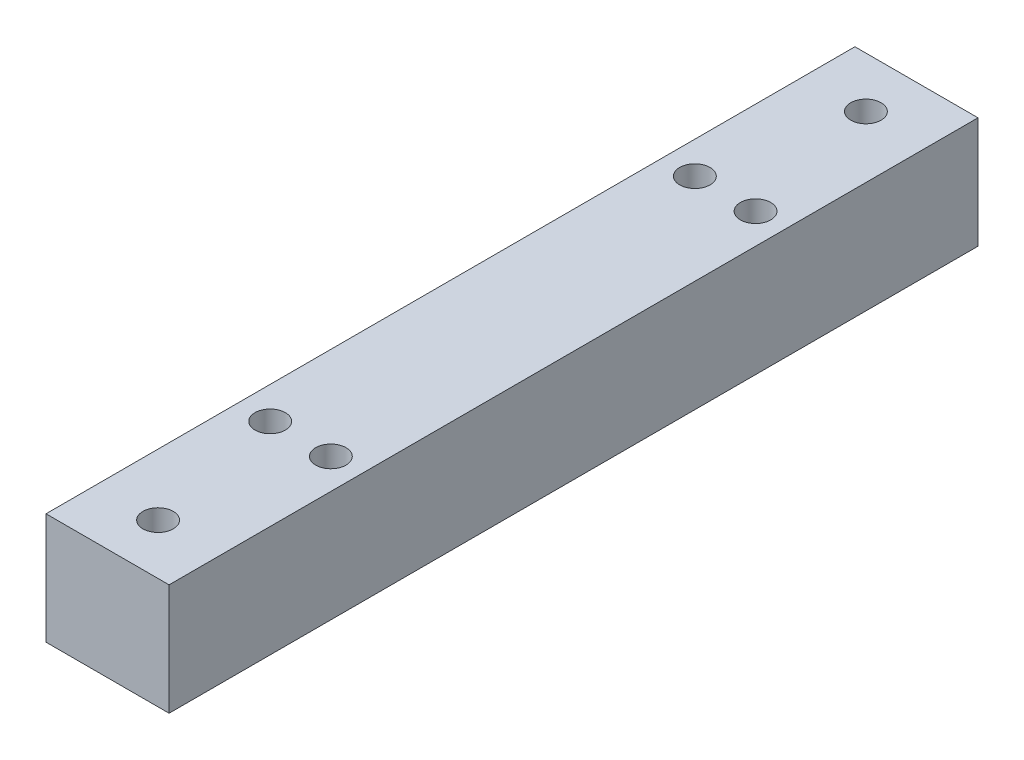
ISO-10303-21;
HEADER;
FILE_DESCRIPTION(('STEP AP214'),'2;1');
FILE_NAME('part.step','',(''),(''),'','','');
FILE_SCHEMA(('AUTOMOTIVE_DESIGN { 1 0 10303 214 1 1 1 1 }'));
ENDSEC;
DATA;
#1=APPLICATION_CONTEXT('core data for automotive mechanical design processes');
#2=APPLICATION_PROTOCOL_DEFINITION('international standard','automotive_design',2000,#1);
#3=PRODUCT_CONTEXT('',#1,'mechanical');
#4=PRODUCT('Part','Part','',(#3));
#5=PRODUCT_RELATED_PRODUCT_CATEGORY('part','',(#4));
#6=PRODUCT_DEFINITION_FORMATION('','',#4);
#7=PRODUCT_DEFINITION_CONTEXT('part definition',#1,'design');
#8=PRODUCT_DEFINITION('design','',#6,#7);
#9=PRODUCT_DEFINITION_SHAPE('','',#8);
#10=(LENGTH_UNIT() NAMED_UNIT(*) SI_UNIT(.MILLI.,.METRE.));
#11=(NAMED_UNIT(*) PLANE_ANGLE_UNIT() SI_UNIT($,.RADIAN.));
#12=(NAMED_UNIT(*) SI_UNIT($,.STERADIAN.) SOLID_ANGLE_UNIT());
#13=UNCERTAINTY_MEASURE_WITH_UNIT(LENGTH_MEASURE(1.E-05),#10,'distance_accuracy_value','');
#14=(GEOMETRIC_REPRESENTATION_CONTEXT(3) GLOBAL_UNCERTAINTY_ASSIGNED_CONTEXT((#13)) GLOBAL_UNIT_ASSIGNED_CONTEXT((#10,
#11,#12)) REPRESENTATION_CONTEXT('',''));
#15=CARTESIAN_POINT('',(0.,0.,0.));
#16=DIRECTION('',(0.,0.,1.));
#17=DIRECTION('',(1.,0.,0.));
#18=AXIS2_PLACEMENT_3D('',#15,#16,#17);
#19=CARTESIAN_POINT('',(0.,0.,80.));
#20=DIRECTION('',(1.,0.,0.));
#21=DIRECTION('',(0.,0.,-1.));
#22=AXIS2_PLACEMENT_3D('',#19,#20,#21);
#23=PLANE('',#22);
#24=DIRECTION('',(0.,-1.,0.));
#25=VECTOR('',#24,1.);
#26=CARTESIAN_POINT('',(0.,0.,0.));
#27=LINE('',#26,#25);
#28=CARTESIAN_POINT('',(0.,11.,0.));
#29=VERTEX_POINT('',#28);
#30=CARTESIAN_POINT('',(0.,0.,0.));
#31=VERTEX_POINT('',#30);
#32=EDGE_CURVE('E101',#29,#31,#27,.T.);
#33=ORIENTED_EDGE('',*,*,#32,.T.);
#34=DIRECTION('',(0.,0.,-1.));
#35=VECTOR('',#34,1.);
#36=CARTESIAN_POINT('',(0.,0.,80.));
#37=LINE('',#36,#35);
#38=CARTESIAN_POINT('',(0.,0.,80.));
#39=VERTEX_POINT('',#38);
#40=EDGE_CURVE('E11',#39,#31,#37,.T.);
#41=ORIENTED_EDGE('',*,*,#40,.F.);
#42=DIRECTION('',(0.,-1.,0.));
#43=VECTOR('',#42,1.);
#44=CARTESIAN_POINT('',(0.,0.,80.));
#45=LINE('',#44,#43);
#46=CARTESIAN_POINT('',(0.,11.,80.));
#47=VERTEX_POINT('',#46);
#48=EDGE_CURVE('E89',#47,#39,#45,.T.);
#49=ORIENTED_EDGE('',*,*,#48,.F.);
#50=DIRECTION('',(0.,0.,-1.));
#51=VECTOR('',#50,1.);
#52=CARTESIAN_POINT('',(0.,11.,80.));
#53=LINE('',#52,#51);
#54=EDGE_CURVE('E97',#47,#29,#53,.T.);
#55=ORIENTED_EDGE('',*,*,#54,.T.);
#56=EDGE_LOOP('',(#33,#41,#49,#55));
#57=FACE_BOUND('',#56,.T.);
#58=ADVANCED_FACE('F38',(#57),#23,.F.);
#59=CARTESIAN_POINT('',(0.,0.,80.));
#60=DIRECTION('',(0.,1.,0.));
#61=DIRECTION('',(0.,0.,1.));
#62=AXIS2_PLACEMENT_3D('',#59,#60,#61);
#63=PLANE('',#62);
#64=CARTESIAN_POINT('',(6.085,0.,75.));
#65=DIRECTION('',(0.,1.,0.));
#66=DIRECTION('',(0.,0.,1.));
#67=AXIS2_PLACEMENT_3D('',#64,#65,#66);
#68=CIRCLE('',#67,1.5);
#69=CARTESIAN_POINT('',(6.085,0.,76.5));
#70=VERTEX_POINT('',#69);
#71=EDGE_CURVE('E138',#70,#70,#68,.T.);
#72=ORIENTED_EDGE('',*,*,#71,.T.);
#73=EDGE_LOOP('',(#72));
#74=FACE_BOUND('',#73,.T.);
#75=CARTESIAN_POINT('',(6.08499999999999,0.,5.));
#76=DIRECTION('',(0.,1.,0.));
#77=DIRECTION('',(0.,0.,1.));
#78=AXIS2_PLACEMENT_3D('',#75,#76,#77);
#79=CIRCLE('',#78,1.5);
#80=CARTESIAN_POINT('',(6.08499999999999,0.,6.5));
#81=VERTEX_POINT('',#80);
#82=EDGE_CURVE('E141',#81,#81,#79,.T.);
#83=ORIENTED_EDGE('',*,*,#82,.T.);
#84=EDGE_LOOP('',(#83));
#85=FACE_BOUND('',#84,.T.);
#86=CARTESIAN_POINT('',(9.171,0.,61.));
#87=DIRECTION('',(0.,1.,0.));
#88=DIRECTION('',(0.,0.,1.));
#89=AXIS2_PLACEMENT_3D('',#86,#87,#88);
#90=CIRCLE('',#89,1.5);
#91=CARTESIAN_POINT('',(9.171,0.,62.5));
#92=VERTEX_POINT('',#91);
#93=EDGE_CURVE('E104',#92,#92,#90,.T.);
#94=ORIENTED_EDGE('',*,*,#93,.T.);
#95=EDGE_LOOP('',(#94));
#96=FACE_BOUND('',#95,.T.);
#97=CARTESIAN_POINT('',(3.17,0.,19.));
#98=DIRECTION('',(0.,1.,0.));
#99=DIRECTION('',(0.,0.,1.));
#100=AXIS2_PLACEMENT_3D('',#97,#98,#99);
#101=CIRCLE('',#100,1.5);
#102=CARTESIAN_POINT('',(3.17,0.,20.5));
#103=VERTEX_POINT('',#102);
#104=EDGE_CURVE('E117',#103,#103,#101,.T.);
#105=ORIENTED_EDGE('',*,*,#104,.T.);
#106=EDGE_LOOP('',(#105));
#107=FACE_BOUND('',#106,.T.);
#108=CARTESIAN_POINT('',(9.171,0.,19.));
#109=DIRECTION('',(0.,1.,0.));
#110=DIRECTION('',(0.,0.,1.));
#111=AXIS2_PLACEMENT_3D('',#108,#109,#110);
#112=CIRCLE('',#111,1.5);
#113=CARTESIAN_POINT('',(9.171,0.,20.5));
#114=VERTEX_POINT('',#113);
#115=EDGE_CURVE('E120',#114,#114,#112,.T.);
#116=ORIENTED_EDGE('',*,*,#115,.T.);
#117=EDGE_LOOP('',(#116));
#118=FACE_BOUND('',#117,.T.);
#119=CARTESIAN_POINT('',(3.17,0.,61.));
#120=DIRECTION('',(0.,1.,0.));
#121=DIRECTION('',(0.,0.,1.));
#122=AXIS2_PLACEMENT_3D('',#119,#120,#121);
#123=CIRCLE('',#122,1.5);
#124=CARTESIAN_POINT('',(3.17,0.,62.5));
#125=VERTEX_POINT('',#124);
#126=EDGE_CURVE('E123',#125,#125,#123,.T.);
#127=ORIENTED_EDGE('',*,*,#126,.T.);
#128=EDGE_LOOP('',(#127));
#129=FACE_BOUND('',#128,.T.);
#130=DIRECTION('',(1.,0.,0.));
#131=VECTOR('',#130,1.);
#132=CARTESIAN_POINT('',(0.,0.,0.));
#133=LINE('',#132,#131);
#134=CARTESIAN_POINT('',(12.171,0.,0.));
#135=VERTEX_POINT('',#134);
#136=EDGE_CURVE('E93',#31,#135,#133,.T.);
#137=ORIENTED_EDGE('',*,*,#136,.T.);
#138=DIRECTION('',(0.,0.,-1.));
#139=VECTOR('',#138,1.);
#140=CARTESIAN_POINT('',(12.171,0.,80.));
#141=LINE('',#140,#139);
#142=CARTESIAN_POINT('',(12.171,0.,80.));
#143=VERTEX_POINT('',#142);
#144=EDGE_CURVE('E46',#143,#135,#141,.T.);
#145=ORIENTED_EDGE('',*,*,#144,.F.);
#146=DIRECTION('',(1.,0.,0.));
#147=VECTOR('',#146,1.);
#148=CARTESIAN_POINT('',(0.,0.,80.));
#149=LINE('',#148,#147);
#150=EDGE_CURVE('E84',#39,#143,#149,.T.);
#151=ORIENTED_EDGE('',*,*,#150,.F.);
#152=ORIENTED_EDGE('',*,*,#40,.T.);
#153=EDGE_LOOP('',(#137,#145,#151,#152));
#154=FACE_BOUND('',#153,.T.);
#155=ADVANCED_FACE('F92',(#74,#85,#96,#107,#118,#129,#154),#63,.F.);
#156=CARTESIAN_POINT('',(12.171,0.,80.));
#157=DIRECTION('',(-1.,0.,0.));
#158=DIRECTION('',(0.,0.,1.));
#159=AXIS2_PLACEMENT_3D('',#156,#157,#158);
#160=PLANE('',#159);
#161=DIRECTION('',(0.,1.,0.));
#162=VECTOR('',#161,1.);
#163=CARTESIAN_POINT('',(12.171,0.,0.));
#164=LINE('',#163,#162);
#165=CARTESIAN_POINT('',(12.171,11.,0.));
#166=VERTEX_POINT('',#165);
#167=EDGE_CURVE('E71',#135,#166,#164,.T.);
#168=ORIENTED_EDGE('',*,*,#167,.T.);
#169=DIRECTION('',(0.,0.,-1.));
#170=VECTOR('',#169,1.);
#171=CARTESIAN_POINT('',(12.171,11.,80.));
#172=LINE('',#171,#170);
#173=CARTESIAN_POINT('',(12.171,11.,80.));
#174=VERTEX_POINT('',#173);
#175=EDGE_CURVE('E94',#174,#166,#172,.T.);
#176=ORIENTED_EDGE('',*,*,#175,.F.);
#177=DIRECTION('',(0.,1.,0.));
#178=VECTOR('',#177,1.);
#179=CARTESIAN_POINT('',(12.171,0.,80.));
#180=LINE('',#179,#178);
#181=EDGE_CURVE('E87',#143,#174,#180,.T.);
#182=ORIENTED_EDGE('',*,*,#181,.F.);
#183=ORIENTED_EDGE('',*,*,#144,.T.);
#184=EDGE_LOOP('',(#168,#176,#182,#183));
#185=FACE_BOUND('',#184,.T.);
#186=ADVANCED_FACE('F95',(#185),#160,.F.);
#187=CARTESIAN_POINT('',(0.,11.,80.));
#188=DIRECTION('',(0.,-1.,0.));
#189=DIRECTION('',(0.,0.,-1.));
#190=AXIS2_PLACEMENT_3D('',#187,#188,#189);
#191=PLANE('',#190);
#192=CARTESIAN_POINT('',(6.085,11.,75.));
#193=DIRECTION('',(0.,1.,0.));
#194=DIRECTION('',(0.,0.,1.));
#195=AXIS2_PLACEMENT_3D('',#192,#193,#194);
#196=CIRCLE('',#195,1.5);
#197=CARTESIAN_POINT('',(6.085,11.,76.5));
#198=VERTEX_POINT('',#197);
#199=EDGE_CURVE('E144',#198,#198,#196,.T.);
#200=ORIENTED_EDGE('',*,*,#199,.F.);
#201=EDGE_LOOP('',(#200));
#202=FACE_BOUND('',#201,.T.);
#203=CARTESIAN_POINT('',(6.08499999999999,11.,5.));
#204=DIRECTION('',(0.,1.,0.));
#205=DIRECTION('',(0.,0.,-1.));
#206=AXIS2_PLACEMENT_3D('',#203,#204,#205);
#207=CIRCLE('',#206,1.5);
#208=CARTESIAN_POINT('',(6.08499999999999,11.,3.5));
#209=VERTEX_POINT('',#208);
#210=EDGE_CURVE('E145',#209,#209,#207,.T.);
#211=ORIENTED_EDGE('',*,*,#210,.F.);
#212=EDGE_LOOP('',(#211));
#213=FACE_BOUND('',#212,.T.);
#214=CARTESIAN_POINT('',(9.171,11.,61.));
#215=DIRECTION('',(0.,1.,0.));
#216=DIRECTION('',(0.,0.,1.));
#217=AXIS2_PLACEMENT_3D('',#214,#215,#216);
#218=CIRCLE('',#217,1.5);
#219=CARTESIAN_POINT('',(9.171,11.,62.5));
#220=VERTEX_POINT('',#219);
#221=EDGE_CURVE('E129',#220,#220,#218,.T.);
#222=ORIENTED_EDGE('',*,*,#221,.F.);
#223=EDGE_LOOP('',(#222));
#224=FACE_BOUND('',#223,.T.);
#225=CARTESIAN_POINT('',(3.17,11.,19.));
#226=DIRECTION('',(0.,1.,0.));
#227=DIRECTION('',(0.,0.,-1.));
#228=AXIS2_PLACEMENT_3D('',#225,#226,#227);
#229=CIRCLE('',#228,1.5);
#230=CARTESIAN_POINT('',(3.17,11.,17.5));
#231=VERTEX_POINT('',#230);
#232=EDGE_CURVE('E130',#231,#231,#229,.T.);
#233=ORIENTED_EDGE('',*,*,#232,.F.);
#234=EDGE_LOOP('',(#233));
#235=FACE_BOUND('',#234,.T.);
#236=CARTESIAN_POINT('',(9.171,11.,19.));
#237=DIRECTION('',(0.,1.,0.));
#238=DIRECTION('',(0.,0.,-1.));
#239=AXIS2_PLACEMENT_3D('',#236,#237,#238);
#240=CIRCLE('',#239,1.5);
#241=CARTESIAN_POINT('',(9.171,11.,17.5));
#242=VERTEX_POINT('',#241);
#243=EDGE_CURVE('E133',#242,#242,#240,.T.);
#244=ORIENTED_EDGE('',*,*,#243,.F.);
#245=EDGE_LOOP('',(#244));
#246=FACE_BOUND('',#245,.T.);
#247=CARTESIAN_POINT('',(3.17,11.,61.));
#248=DIRECTION('',(0.,1.,0.));
#249=DIRECTION('',(0.,0.,1.));
#250=AXIS2_PLACEMENT_3D('',#247,#248,#249);
#251=CIRCLE('',#250,1.5);
#252=CARTESIAN_POINT('',(3.17,11.,62.5));
#253=VERTEX_POINT('',#252);
#254=EDGE_CURVE('E126',#253,#253,#251,.T.);
#255=ORIENTED_EDGE('',*,*,#254,.F.);
#256=EDGE_LOOP('',(#255));
#257=FACE_BOUND('',#256,.T.);
#258=DIRECTION('',(-1.,0.,0.));
#259=VECTOR('',#258,1.);
#260=CARTESIAN_POINT('',(0.,11.,0.));
#261=LINE('',#260,#259);
#262=EDGE_CURVE('E77',#166,#29,#261,.T.);
#263=ORIENTED_EDGE('',*,*,#262,.T.);
#264=ORIENTED_EDGE('',*,*,#54,.F.);
#265=DIRECTION('',(-1.,0.,0.));
#266=VECTOR('',#265,1.);
#267=CARTESIAN_POINT('',(0.,11.,80.));
#268=LINE('',#267,#266);
#269=EDGE_CURVE('E54',#174,#47,#268,.T.);
#270=ORIENTED_EDGE('',*,*,#269,.F.);
#271=ORIENTED_EDGE('',*,*,#175,.T.);
#272=EDGE_LOOP('',(#263,#264,#270,#271));
#273=FACE_BOUND('',#272,.T.);
#274=ADVANCED_FACE('F109',(#202,#213,#224,#235,#246,#257,#273),#191,.F.);
#275=CARTESIAN_POINT('',(0.,0.,80.));
#276=DIRECTION('',(0.,0.,-1.));
#277=DIRECTION('',(-1.,0.,0.));
#278=AXIS2_PLACEMENT_3D('',#275,#276,#277);
#279=PLANE('',#278);
#280=ORIENTED_EDGE('',*,*,#48,.T.);
#281=ORIENTED_EDGE('',*,*,#150,.T.);
#282=ORIENTED_EDGE('',*,*,#181,.T.);
#283=ORIENTED_EDGE('',*,*,#269,.T.);
#284=EDGE_LOOP('',(#280,#281,#282,#283));
#285=FACE_BOUND('',#284,.T.);
#286=ADVANCED_FACE('F85',(#285),#279,.F.);
#287=CARTESIAN_POINT('',(0.,0.,0.));
#288=DIRECTION('',(0.,0.,-1.));
#289=DIRECTION('',(-1.,0.,0.));
#290=AXIS2_PLACEMENT_3D('',#287,#288,#289);
#291=PLANE('',#290);
#292=ORIENTED_EDGE('',*,*,#32,.F.);
#293=ORIENTED_EDGE('',*,*,#262,.F.);
#294=ORIENTED_EDGE('',*,*,#167,.F.);
#295=ORIENTED_EDGE('',*,*,#136,.F.);
#296=EDGE_LOOP('',(#292,#293,#294,#295));
#297=FACE_BOUND('',#296,.T.);
#298=ADVANCED_FACE('F112',(#297),#291,.T.);
#299=CARTESIAN_POINT('',(3.17,-4.,61.));
#300=DIRECTION('',(0.,1.,0.));
#301=DIRECTION('',(0.,0.,1.));
#302=AXIS2_PLACEMENT_3D('',#299,#300,#301);
#303=CYLINDRICAL_SURFACE('',#302,1.5);
#304=ORIENTED_EDGE('',*,*,#254,.T.);
#305=EDGE_LOOP('',(#304));
#306=FACE_BOUND('',#305,.T.);
#307=ORIENTED_EDGE('',*,*,#126,.F.);
#308=EDGE_LOOP('',(#307));
#309=FACE_BOUND('',#308,.T.);
#310=ADVANCED_FACE('F167',(#306,#309),#303,.F.);
#311=CARTESIAN_POINT('',(9.171,-4.,19.));
#312=DIRECTION('',(0.,1.,0.));
#313=DIRECTION('',(0.,0.,1.));
#314=AXIS2_PLACEMENT_3D('',#311,#312,#313);
#315=CYLINDRICAL_SURFACE('',#314,1.5);
#316=ORIENTED_EDGE('',*,*,#243,.T.);
#317=EDGE_LOOP('',(#316));
#318=FACE_BOUND('',#317,.T.);
#319=ORIENTED_EDGE('',*,*,#115,.F.);
#320=EDGE_LOOP('',(#319));
#321=FACE_BOUND('',#320,.T.);
#322=ADVANCED_FACE('F170',(#318,#321),#315,.F.);
#323=CARTESIAN_POINT('',(3.17,-4.,19.));
#324=DIRECTION('',(0.,1.,0.));
#325=DIRECTION('',(0.,0.,1.));
#326=AXIS2_PLACEMENT_3D('',#323,#324,#325);
#327=CYLINDRICAL_SURFACE('',#326,1.5);
#328=ORIENTED_EDGE('',*,*,#232,.T.);
#329=EDGE_LOOP('',(#328));
#330=FACE_BOUND('',#329,.T.);
#331=ORIENTED_EDGE('',*,*,#104,.F.);
#332=EDGE_LOOP('',(#331));
#333=FACE_BOUND('',#332,.T.);
#334=ADVANCED_FACE('F188',(#330,#333),#327,.F.);
#335=CARTESIAN_POINT('',(9.171,-4.,61.));
#336=DIRECTION('',(0.,1.,0.));
#337=DIRECTION('',(0.,0.,1.));
#338=AXIS2_PLACEMENT_3D('',#335,#336,#337);
#339=CYLINDRICAL_SURFACE('',#338,1.5);
#340=ORIENTED_EDGE('',*,*,#221,.T.);
#341=EDGE_LOOP('',(#340));
#342=FACE_BOUND('',#341,.T.);
#343=ORIENTED_EDGE('',*,*,#93,.F.);
#344=EDGE_LOOP('',(#343));
#345=FACE_BOUND('',#344,.T.);
#346=ADVANCED_FACE('F191',(#342,#345),#339,.F.);
#347=CARTESIAN_POINT('',(6.08499999999999,-16.,5.));
#348=DIRECTION('',(0.,1.,0.));
#349=DIRECTION('',(0.,0.,1.));
#350=AXIS2_PLACEMENT_3D('',#347,#348,#349);
#351=CYLINDRICAL_SURFACE('',#350,1.5);
#352=ORIENTED_EDGE('',*,*,#210,.T.);
#353=EDGE_LOOP('',(#352));
#354=FACE_BOUND('',#353,.T.);
#355=ORIENTED_EDGE('',*,*,#82,.F.);
#356=EDGE_LOOP('',(#355));
#357=FACE_BOUND('',#356,.T.);
#358=ADVANCED_FACE('F195',(#354,#357),#351,.F.);
#359=CARTESIAN_POINT('',(6.085,-16.,75.));
#360=DIRECTION('',(0.,1.,0.));
#361=DIRECTION('',(0.,0.,1.));
#362=AXIS2_PLACEMENT_3D('',#359,#360,#361);
#363=CYLINDRICAL_SURFACE('',#362,1.5);
#364=ORIENTED_EDGE('',*,*,#199,.T.);
#365=EDGE_LOOP('',(#364));
#366=FACE_BOUND('',#365,.T.);
#367=ORIENTED_EDGE('',*,*,#71,.F.);
#368=EDGE_LOOP('',(#367));
#369=FACE_BOUND('',#368,.T.);
#370=ADVANCED_FACE('F151',(#366,#369),#363,.F.);
#371=CLOSED_SHELL('',(#58,#155,#186,#274,#286,#298,#310,#322,#334,#346,#358,#370));
#372=MANIFOLD_SOLID_BREP('B2',#371);
#373=ADVANCED_BREP_SHAPE_REPRESENTATION('',(#18,#372),#14);
#374=SHAPE_DEFINITION_REPRESENTATION(#9,#373);
ENDSEC;
END-ISO-10303-21;
